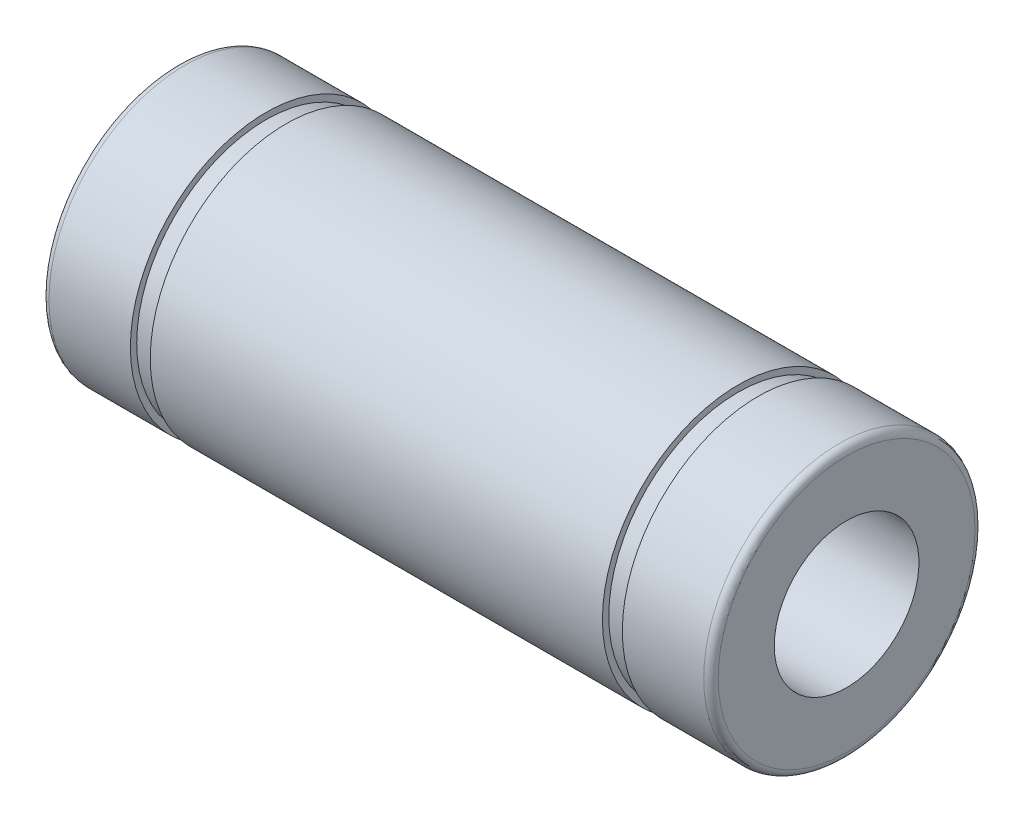
ISO-10303-21;
HEADER;
FILE_DESCRIPTION(('STEP AP214'),'2;1');
FILE_NAME('part.step','',(''),(''),'','','');
FILE_SCHEMA(('AUTOMOTIVE_DESIGN { 1 0 10303 214 1 1 1 1 }'));
ENDSEC;
DATA;
#1=APPLICATION_CONTEXT('core data for automotive mechanical design processes');
#2=APPLICATION_PROTOCOL_DEFINITION('international standard','automotive_design',2000,#1);
#3=PRODUCT_CONTEXT('',#1,'mechanical');
#4=PRODUCT('Part','Part','',(#3));
#5=PRODUCT_RELATED_PRODUCT_CATEGORY('part','',(#4));
#6=PRODUCT_DEFINITION_FORMATION('','',#4);
#7=PRODUCT_DEFINITION_CONTEXT('part definition',#1,'design');
#8=PRODUCT_DEFINITION('design','',#6,#7);
#9=PRODUCT_DEFINITION_SHAPE('','',#8);
#10=(LENGTH_UNIT() NAMED_UNIT(*) SI_UNIT(.MILLI.,.METRE.));
#11=(NAMED_UNIT(*) PLANE_ANGLE_UNIT() SI_UNIT($,.RADIAN.));
#12=(NAMED_UNIT(*) SI_UNIT($,.STERADIAN.) SOLID_ANGLE_UNIT());
#13=UNCERTAINTY_MEASURE_WITH_UNIT(LENGTH_MEASURE(1.E-05),#10,'distance_accuracy_value','');
#14=(GEOMETRIC_REPRESENTATION_CONTEXT(3) GLOBAL_UNCERTAINTY_ASSIGNED_CONTEXT((#13)) GLOBAL_UNIT_ASSIGNED_CONTEXT((#10,
#11,#12)) REPRESENTATION_CONTEXT('',''));
#15=CARTESIAN_POINT('',(0.,0.,0.));
#16=DIRECTION('',(0.,0.,1.));
#17=DIRECTION('',(1.,0.,0.));
#18=AXIS2_PLACEMENT_3D('',#15,#16,#17);
#19=CARTESIAN_POINT('',(-18.1,0.,0.));
#20=DIRECTION('',(-1.,0.,0.));
#21=DIRECTION('',(0.,0.,1.));
#22=AXIS2_PLACEMENT_3D('',#19,#20,#21);
#23=TOROIDAL_SURFACE('',#22,7.09999999999996,0.400000000000031);
#24=CARTESIAN_POINT('',(-18.5,0.,0.));
#25=DIRECTION('',(-1.,0.,0.));
#26=DIRECTION('',(0.,0.,1.));
#27=AXIS2_PLACEMENT_3D('',#24,#25,#26);
#28=CIRCLE('',#27,7.09999999999996);
#29=CARTESIAN_POINT('',(-18.5,0.,7.09999999999996));
#30=VERTEX_POINT('',#29);
#31=EDGE_CURVE('E10',#30,#30,#28,.T.);
#32=ORIENTED_EDGE('',*,*,#31,.F.);
#33=EDGE_LOOP('',(#32));
#34=FACE_BOUND('',#33,.T.);
#35=CARTESIAN_POINT('',(-18.1,0.,0.));
#36=DIRECTION('',(-1.,0.,0.));
#37=DIRECTION('',(0.,0.,1.));
#38=AXIS2_PLACEMENT_3D('',#35,#36,#37);
#39=CIRCLE('',#38,7.5);
#40=CARTESIAN_POINT('',(-18.1,0.,7.5));
#41=VERTEX_POINT('',#40);
#42=EDGE_CURVE('E74',#41,#41,#39,.T.);
#43=ORIENTED_EDGE('',*,*,#42,.T.);
#44=EDGE_LOOP('',(#43));
#45=FACE_BOUND('',#44,.T.);
#46=ADVANCED_FACE('F28',(#34,#45),#23,.T.);
#47=CARTESIAN_POINT('',(-18.5,7.09999999999996,0.));
#48=DIRECTION('',(1.,0.,0.));
#49=DIRECTION('',(0.,0.,-1.));
#50=AXIS2_PLACEMENT_3D('',#47,#48,#49);
#51=PLANE('',#50);
#52=CARTESIAN_POINT('',(-18.5,0.,0.));
#53=DIRECTION('',(-1.,0.,0.));
#54=DIRECTION('',(0.,0.,1.));
#55=AXIS2_PLACEMENT_3D('',#52,#53,#54);
#56=CIRCLE('',#55,4.);
#57=CARTESIAN_POINT('',(-18.5,0.,4.));
#58=VERTEX_POINT('',#57);
#59=EDGE_CURVE('E34',#58,#58,#56,.T.);
#60=ORIENTED_EDGE('',*,*,#59,.F.);
#61=EDGE_LOOP('',(#60));
#62=FACE_BOUND('',#61,.T.);
#63=ORIENTED_EDGE('',*,*,#31,.T.);
#64=EDGE_LOOP('',(#63));
#65=FACE_BOUND('',#64,.T.);
#66=ADVANCED_FACE('F147',(#62,#65),#51,.F.);
#67=CARTESIAN_POINT('',(18.5,0.,0.));
#68=DIRECTION('',(-1.,0.,0.));
#69=DIRECTION('',(0.,0.,1.));
#70=AXIS2_PLACEMENT_3D('',#67,#68,#69);
#71=CYLINDRICAL_SURFACE('',#70,4.);
#72=CARTESIAN_POINT('',(18.5,0.,0.));
#73=DIRECTION('',(-1.,0.,0.));
#74=DIRECTION('',(0.,0.,1.));
#75=AXIS2_PLACEMENT_3D('',#72,#73,#74);
#76=CIRCLE('',#75,4.);
#77=CARTESIAN_POINT('',(18.5,0.,4.));
#78=VERTEX_POINT('',#77);
#79=EDGE_CURVE('E38',#78,#78,#76,.T.);
#80=ORIENTED_EDGE('',*,*,#79,.F.);
#81=EDGE_LOOP('',(#80));
#82=FACE_BOUND('',#81,.T.);
#83=ORIENTED_EDGE('',*,*,#59,.T.);
#84=EDGE_LOOP('',(#83));
#85=FACE_BOUND('',#84,.T.);
#86=ADVANCED_FACE('F142',(#82,#85),#71,.F.);
#87=CARTESIAN_POINT('',(18.5,4.,0.));
#88=DIRECTION('',(-1.,0.,0.));
#89=DIRECTION('',(0.,0.,1.));
#90=AXIS2_PLACEMENT_3D('',#87,#88,#89);
#91=PLANE('',#90);
#92=CARTESIAN_POINT('',(18.5,0.,0.));
#93=DIRECTION('',(-1.,0.,0.));
#94=DIRECTION('',(0.,0.,1.));
#95=AXIS2_PLACEMENT_3D('',#92,#93,#94);
#96=CIRCLE('',#95,7.09999999999997);
#97=CARTESIAN_POINT('',(18.5,0.,7.09999999999997));
#98=VERTEX_POINT('',#97);
#99=EDGE_CURVE('E42',#98,#98,#96,.T.);
#100=ORIENTED_EDGE('',*,*,#99,.F.);
#101=EDGE_LOOP('',(#100));
#102=FACE_BOUND('',#101,.T.);
#103=ORIENTED_EDGE('',*,*,#79,.T.);
#104=EDGE_LOOP('',(#103));
#105=FACE_BOUND('',#104,.T.);
#106=ADVANCED_FACE('F136',(#102,#105),#91,.F.);
#107=CARTESIAN_POINT('',(18.1,0.,0.));
#108=DIRECTION('',(-1.,0.,0.));
#109=DIRECTION('',(0.,0.,1.));
#110=AXIS2_PLACEMENT_3D('',#107,#108,#109);
#111=TOROIDAL_SURFACE('',#110,7.09999999999997,0.400000000000031);
#112=CARTESIAN_POINT('',(18.1,0.,0.));
#113=DIRECTION('',(-1.,0.,0.));
#114=DIRECTION('',(0.,0.,1.));
#115=AXIS2_PLACEMENT_3D('',#112,#113,#114);
#116=CIRCLE('',#115,7.5);
#117=CARTESIAN_POINT('',(18.1,0.,7.5));
#118=VERTEX_POINT('',#117);
#119=EDGE_CURVE('E47',#118,#118,#116,.T.);
#120=ORIENTED_EDGE('',*,*,#119,.F.);
#121=EDGE_LOOP('',(#120));
#122=FACE_BOUND('',#121,.T.);
#123=ORIENTED_EDGE('',*,*,#99,.T.);
#124=EDGE_LOOP('',(#123));
#125=FACE_BOUND('',#124,.T.);
#126=ADVANCED_FACE('F130',(#122,#125),#111,.T.);
#127=CARTESIAN_POINT('',(18.5,0.,0.));
#128=DIRECTION('',(-1.,0.,0.));
#129=DIRECTION('',(0.,0.,1.));
#130=AXIS2_PLACEMENT_3D('',#127,#128,#129);
#131=CYLINDRICAL_SURFACE('',#130,7.5);
#132=CARTESIAN_POINT('',(13.6,0.,0.));
#133=DIRECTION('',(-1.,0.,0.));
#134=DIRECTION('',(0.,0.,1.));
#135=AXIS2_PLACEMENT_3D('',#132,#133,#134);
#136=CIRCLE('',#135,7.5);
#137=CARTESIAN_POINT('',(13.6,0.,7.5));
#138=VERTEX_POINT('',#137);
#139=EDGE_CURVE('E50',#138,#138,#136,.T.);
#140=ORIENTED_EDGE('',*,*,#139,.F.);
#141=EDGE_LOOP('',(#140));
#142=FACE_BOUND('',#141,.T.);
#143=ORIENTED_EDGE('',*,*,#119,.T.);
#144=EDGE_LOOP('',(#143));
#145=FACE_BOUND('',#144,.T.);
#146=ADVANCED_FACE('F124',(#142,#145),#131,.T.);
#147=CARTESIAN_POINT('',(13.6,7.5,0.));
#148=DIRECTION('',(1.,0.,0.));
#149=DIRECTION('',(0.,0.,-1.));
#150=AXIS2_PLACEMENT_3D('',#147,#148,#149);
#151=PLANE('',#150);
#152=CARTESIAN_POINT('',(13.6,0.,0.));
#153=DIRECTION('',(-1.,0.,0.));
#154=DIRECTION('',(0.,0.,1.));
#155=AXIS2_PLACEMENT_3D('',#152,#153,#154);
#156=CIRCLE('',#155,7.15);
#157=CARTESIAN_POINT('',(13.6,0.,7.15));
#158=VERTEX_POINT('',#157);
#159=EDGE_CURVE('E53',#158,#158,#156,.T.);
#160=ORIENTED_EDGE('',*,*,#159,.F.);
#161=EDGE_LOOP('',(#160));
#162=FACE_BOUND('',#161,.T.);
#163=ORIENTED_EDGE('',*,*,#139,.T.);
#164=EDGE_LOOP('',(#163));
#165=FACE_BOUND('',#164,.T.);
#166=ADVANCED_FACE('F118',(#162,#165),#151,.F.);
#167=CARTESIAN_POINT('',(18.5,0.,0.));
#168=DIRECTION('',(-1.,0.,0.));
#169=DIRECTION('',(0.,0.,1.));
#170=AXIS2_PLACEMENT_3D('',#167,#168,#169);
#171=CYLINDRICAL_SURFACE('',#170,7.15);
#172=CARTESIAN_POINT('',(12.5,0.,0.));
#173=DIRECTION('',(-1.,0.,0.));
#174=DIRECTION('',(0.,0.,1.));
#175=AXIS2_PLACEMENT_3D('',#172,#173,#174);
#176=CIRCLE('',#175,7.15);
#177=CARTESIAN_POINT('',(12.5,0.,7.15));
#178=VERTEX_POINT('',#177);
#179=EDGE_CURVE('E56',#178,#178,#176,.T.);
#180=ORIENTED_EDGE('',*,*,#179,.F.);
#181=EDGE_LOOP('',(#180));
#182=FACE_BOUND('',#181,.T.);
#183=ORIENTED_EDGE('',*,*,#159,.T.);
#184=EDGE_LOOP('',(#183));
#185=FACE_BOUND('',#184,.T.);
#186=ADVANCED_FACE('F112',(#182,#185),#171,.T.);
#187=CARTESIAN_POINT('',(12.5,7.15,0.));
#188=DIRECTION('',(-1.,0.,0.));
#189=DIRECTION('',(0.,0.,1.));
#190=AXIS2_PLACEMENT_3D('',#187,#188,#189);
#191=PLANE('',#190);
#192=CARTESIAN_POINT('',(12.5,0.,0.));
#193=DIRECTION('',(-1.,0.,0.));
#194=DIRECTION('',(0.,0.,1.));
#195=AXIS2_PLACEMENT_3D('',#192,#193,#194);
#196=CIRCLE('',#195,7.5);
#197=CARTESIAN_POINT('',(12.5,0.,7.5));
#198=VERTEX_POINT('',#197);
#199=EDGE_CURVE('E59',#198,#198,#196,.T.);
#200=ORIENTED_EDGE('',*,*,#199,.F.);
#201=EDGE_LOOP('',(#200));
#202=FACE_BOUND('',#201,.T.);
#203=ORIENTED_EDGE('',*,*,#179,.T.);
#204=EDGE_LOOP('',(#203));
#205=FACE_BOUND('',#204,.T.);
#206=ADVANCED_FACE('F106',(#202,#205),#191,.F.);
#207=CARTESIAN_POINT('',(18.5,0.,0.));
#208=DIRECTION('',(-1.,0.,0.));
#209=DIRECTION('',(0.,0.,1.));
#210=AXIS2_PLACEMENT_3D('',#207,#208,#209);
#211=CYLINDRICAL_SURFACE('',#210,7.5);
#212=CARTESIAN_POINT('',(-12.5,0.,0.));
#213=DIRECTION('',(-1.,0.,0.));
#214=DIRECTION('',(0.,0.,1.));
#215=AXIS2_PLACEMENT_3D('',#212,#213,#214);
#216=CIRCLE('',#215,7.5);
#217=CARTESIAN_POINT('',(-12.5,0.,7.5));
#218=VERTEX_POINT('',#217);
#219=EDGE_CURVE('E62',#218,#218,#216,.T.);
#220=ORIENTED_EDGE('',*,*,#219,.F.);
#221=EDGE_LOOP('',(#220));
#222=FACE_BOUND('',#221,.T.);
#223=ORIENTED_EDGE('',*,*,#199,.T.);
#224=EDGE_LOOP('',(#223));
#225=FACE_BOUND('',#224,.T.);
#226=ADVANCED_FACE('F100',(#222,#225),#211,.T.);
#227=CARTESIAN_POINT('',(-12.5,7.49999999999999,0.));
#228=DIRECTION('',(1.,0.,0.));
#229=DIRECTION('',(0.,0.,-1.));
#230=AXIS2_PLACEMENT_3D('',#227,#228,#229);
#231=PLANE('',#230);
#232=CARTESIAN_POINT('',(-12.5,0.,0.));
#233=DIRECTION('',(-1.,0.,0.));
#234=DIRECTION('',(0.,0.,1.));
#235=AXIS2_PLACEMENT_3D('',#232,#233,#234);
#236=CIRCLE('',#235,7.15);
#237=CARTESIAN_POINT('',(-12.5,0.,7.15));
#238=VERTEX_POINT('',#237);
#239=EDGE_CURVE('E65',#238,#238,#236,.T.);
#240=ORIENTED_EDGE('',*,*,#239,.F.);
#241=EDGE_LOOP('',(#240));
#242=FACE_BOUND('',#241,.T.);
#243=ORIENTED_EDGE('',*,*,#219,.T.);
#244=EDGE_LOOP('',(#243));
#245=FACE_BOUND('',#244,.T.);
#246=ADVANCED_FACE('F94',(#242,#245),#231,.F.);
#247=CARTESIAN_POINT('',(18.5,0.,0.));
#248=DIRECTION('',(-1.,0.,0.));
#249=DIRECTION('',(0.,0.,1.));
#250=AXIS2_PLACEMENT_3D('',#247,#248,#249);
#251=CYLINDRICAL_SURFACE('',#250,7.15);
#252=CARTESIAN_POINT('',(-13.6,0.,0.));
#253=DIRECTION('',(-1.,0.,0.));
#254=DIRECTION('',(0.,0.,1.));
#255=AXIS2_PLACEMENT_3D('',#252,#253,#254);
#256=CIRCLE('',#255,7.15);
#257=CARTESIAN_POINT('',(-13.6,0.,7.15));
#258=VERTEX_POINT('',#257);
#259=EDGE_CURVE('E68',#258,#258,#256,.T.);
#260=ORIENTED_EDGE('',*,*,#259,.F.);
#261=EDGE_LOOP('',(#260));
#262=FACE_BOUND('',#261,.T.);
#263=ORIENTED_EDGE('',*,*,#239,.T.);
#264=EDGE_LOOP('',(#263));
#265=FACE_BOUND('',#264,.T.);
#266=ADVANCED_FACE('F88',(#262,#265),#251,.T.);
#267=CARTESIAN_POINT('',(-13.6,7.15,0.));
#268=DIRECTION('',(-1.,0.,0.));
#269=DIRECTION('',(0.,0.,1.));
#270=AXIS2_PLACEMENT_3D('',#267,#268,#269);
#271=PLANE('',#270);
#272=CARTESIAN_POINT('',(-13.6,0.,0.));
#273=DIRECTION('',(-1.,0.,0.));
#274=DIRECTION('',(0.,0.,1.));
#275=AXIS2_PLACEMENT_3D('',#272,#273,#274);
#276=CIRCLE('',#275,7.5);
#277=CARTESIAN_POINT('',(-13.6,0.,7.5));
#278=VERTEX_POINT('',#277);
#279=EDGE_CURVE('E71',#278,#278,#276,.T.);
#280=ORIENTED_EDGE('',*,*,#279,.F.);
#281=EDGE_LOOP('',(#280));
#282=FACE_BOUND('',#281,.T.);
#283=ORIENTED_EDGE('',*,*,#259,.T.);
#284=EDGE_LOOP('',(#283));
#285=FACE_BOUND('',#284,.T.);
#286=ADVANCED_FACE('F82',(#282,#285),#271,.F.);
#287=CARTESIAN_POINT('',(18.5,0.,0.));
#288=DIRECTION('',(-1.,0.,0.));
#289=DIRECTION('',(0.,0.,1.));
#290=AXIS2_PLACEMENT_3D('',#287,#288,#289);
#291=CYLINDRICAL_SURFACE('',#290,7.5);
#292=ORIENTED_EDGE('',*,*,#42,.F.);
#293=EDGE_LOOP('',(#292));
#294=FACE_BOUND('',#293,.T.);
#295=ORIENTED_EDGE('',*,*,#279,.T.);
#296=EDGE_LOOP('',(#295));
#297=FACE_BOUND('',#296,.T.);
#298=ADVANCED_FACE('F79',(#294,#297),#291,.T.);
#299=CLOSED_SHELL('',(#46,#66,#86,#106,#126,#146,#166,#186,#206,#226,#246,#266,#286,#298));
#300=MANIFOLD_SOLID_BREP('B2',#299);
#301=ADVANCED_BREP_SHAPE_REPRESENTATION('',(#18,#300),#14);
#302=SHAPE_DEFINITION_REPRESENTATION(#9,#301);
ENDSEC;
END-ISO-10303-21;
